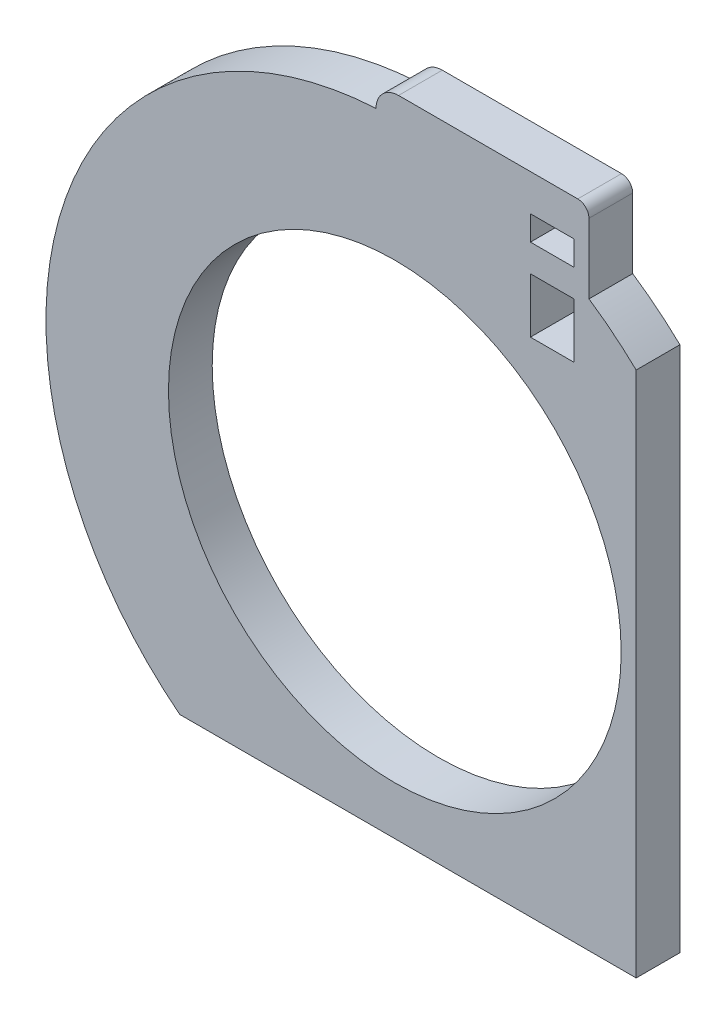
ISO-10303-21;
HEADER;
FILE_DESCRIPTION(('STEP AP214'),'2;1');
FILE_NAME('part.step','',(''),(''),'','','');
FILE_SCHEMA(('AUTOMOTIVE_DESIGN { 1 0 10303 214 1 1 1 1 }'));
ENDSEC;
DATA;
#1=APPLICATION_CONTEXT('core data for automotive mechanical design processes');
#2=APPLICATION_PROTOCOL_DEFINITION('international standard','automotive_design',2000,#1);
#3=PRODUCT_CONTEXT('',#1,'mechanical');
#4=PRODUCT('Part','Part','',(#3));
#5=PRODUCT_RELATED_PRODUCT_CATEGORY('part','',(#4));
#6=PRODUCT_DEFINITION_FORMATION('','',#4);
#7=PRODUCT_DEFINITION_CONTEXT('part definition',#1,'design');
#8=PRODUCT_DEFINITION('design','',#6,#7);
#9=PRODUCT_DEFINITION_SHAPE('','',#8);
#10=(LENGTH_UNIT() NAMED_UNIT(*) SI_UNIT(.MILLI.,.METRE.));
#11=(NAMED_UNIT(*) PLANE_ANGLE_UNIT() SI_UNIT($,.RADIAN.));
#12=(NAMED_UNIT(*) SI_UNIT($,.STERADIAN.) SOLID_ANGLE_UNIT());
#13=UNCERTAINTY_MEASURE_WITH_UNIT(LENGTH_MEASURE(1.E-05),#10,'distance_accuracy_value','');
#14=(GEOMETRIC_REPRESENTATION_CONTEXT(3) GLOBAL_UNCERTAINTY_ASSIGNED_CONTEXT((#13)) GLOBAL_UNIT_ASSIGNED_CONTEXT((#10,
#11,#12)) REPRESENTATION_CONTEXT('',''));
#15=CARTESIAN_POINT('',(0.,0.,0.));
#16=DIRECTION('',(0.,0.,1.));
#17=DIRECTION('',(1.,0.,0.));
#18=AXIS2_PLACEMENT_3D('',#15,#16,#17);
#19=CARTESIAN_POINT('',(0.,0.,5.));
#20=DIRECTION('',(0.,0.,1.));
#21=DIRECTION('',(1.,0.,0.));
#22=AXIS2_PLACEMENT_3D('',#19,#20,#21);
#23=PLANE('',#22);
#24=DIRECTION('',(0.,1.,0.));
#25=VECTOR('',#24,1.);
#26=CARTESIAN_POINT('',(15.5,32.2687019691372,5.));
#27=LINE('',#26,#25);
#28=CARTESIAN_POINT('',(15.5,25.9957959776358,5.));
#29=VERTEX_POINT('',#28);
#30=CARTESIAN_POINT('',(15.5,32.2687019691372,5.));
#31=VERTEX_POINT('',#30);
#32=EDGE_CURVE('E158',#29,#31,#27,.T.);
#33=ORIENTED_EDGE('',*,*,#32,.T.);
#34=DIRECTION('',(1.,0.,0.));
#35=VECTOR('',#34,1.);
#36=CARTESIAN_POINT('',(20.5,32.2687019691372,5.));
#37=LINE('',#36,#35);
#38=CARTESIAN_POINT('',(20.5,32.2687019691372,5.));
#39=VERTEX_POINT('',#38);
#40=EDGE_CURVE('E147',#31,#39,#37,.T.);
#41=ORIENTED_EDGE('',*,*,#40,.T.);
#42=DIRECTION('',(0.,-1.,0.));
#43=VECTOR('',#42,1.);
#44=CARTESIAN_POINT('',(20.5,32.2687019691372,5.));
#45=LINE('',#44,#43);
#46=CARTESIAN_POINT('',(20.5,25.9957959776358,5.));
#47=VERTEX_POINT('',#46);
#48=EDGE_CURVE('E168',#39,#47,#45,.T.);
#49=ORIENTED_EDGE('',*,*,#48,.T.);
#50=DIRECTION('',(-1.,0.,0.));
#51=VECTOR('',#50,1.);
#52=CARTESIAN_POINT('',(20.5,25.9957959776358,5.));
#53=LINE('',#52,#51);
#54=EDGE_CURVE('E164',#47,#29,#53,.T.);
#55=ORIENTED_EDGE('',*,*,#54,.T.);
#56=EDGE_LOOP('',(#33,#41,#49,#55));
#57=FACE_BOUND('',#56,.T.);
#58=DIRECTION('',(0.,1.,0.));
#59=VECTOR('',#58,1.);
#60=CARTESIAN_POINT('',(15.5,38.2072364060484,5.));
#61=LINE('',#60,#59);
#62=CARTESIAN_POINT('',(15.5,35.4002041784689,5.));
#63=VERTEX_POINT('',#62);
#64=CARTESIAN_POINT('',(15.5,38.2072364060484,5.));
#65=VERTEX_POINT('',#64);
#66=EDGE_CURVE('E187',#63,#65,#61,.T.);
#67=ORIENTED_EDGE('',*,*,#66,.T.);
#68=DIRECTION('',(1.,0.,0.));
#69=VECTOR('',#68,1.);
#70=CARTESIAN_POINT('',(20.5,38.2072364060484,5.));
#71=LINE('',#70,#69);
#72=CARTESIAN_POINT('',(20.5,38.2072364060484,5.));
#73=VERTEX_POINT('',#72);
#74=EDGE_CURVE('E204',#65,#73,#71,.T.);
#75=ORIENTED_EDGE('',*,*,#74,.T.);
#76=DIRECTION('',(0.,-1.,0.));
#77=VECTOR('',#76,1.);
#78=CARTESIAN_POINT('',(20.5,38.2072364060484,5.));
#79=LINE('',#78,#77);
#80=CARTESIAN_POINT('',(20.5,35.4002041784689,5.));
#81=VERTEX_POINT('',#80);
#82=EDGE_CURVE('E154',#73,#81,#79,.T.);
#83=ORIENTED_EDGE('',*,*,#82,.T.);
#84=DIRECTION('',(-1.,0.,0.));
#85=VECTOR('',#84,1.);
#86=CARTESIAN_POINT('',(20.5,35.4002041784689,5.));
#87=LINE('',#86,#85);
#88=EDGE_CURVE('E184',#81,#63,#87,.T.);
#89=ORIENTED_EDGE('',*,*,#88,.T.);
#90=EDGE_LOOP('',(#67,#75,#83,#89));
#91=FACE_BOUND('',#90,.T.);
#92=CARTESIAN_POINT('',(0.,0.,5.));
#93=DIRECTION('',(0.,0.,1.));
#94=DIRECTION('',(1.,0.,0.));
#95=AXIS2_PLACEMENT_3D('',#92,#93,#94);
#96=CIRCLE('',#95,39.8690409108862);
#97=CARTESIAN_POINT('',(-2.14506824428968,39.811293691379,5.));
#98=VERTEX_POINT('',#97);
#99=CARTESIAN_POINT('',(-24.576892052644,-31.3929418848668,5.));
#100=VERTEX_POINT('',#99);
#101=EDGE_CURVE('E220',#98,#100,#96,.T.);
#102=ORIENTED_EDGE('',*,*,#101,.T.);
#103=DIRECTION('',(1.,0.,0.));
#104=VECTOR('',#103,1.);
#105=CARTESIAN_POINT('',(27.5855038769169,-31.3929418848668,5.));
#106=LINE('',#105,#104);
#107=CARTESIAN_POINT('',(27.5855038769169,-31.3929418848668,5.));
#108=VERTEX_POINT('',#107);
#109=EDGE_CURVE('E223',#100,#108,#106,.T.);
#110=ORIENTED_EDGE('',*,*,#109,.T.);
#111=DIRECTION('',(0.,1.,0.));
#112=VECTOR('',#111,1.);
#113=CARTESIAN_POINT('',(27.5855038769169,-31.3929418848668,5.));
#114=LINE('',#113,#112);
#115=CARTESIAN_POINT('',(27.5855038769169,28.7850725031308,5.));
#116=VERTEX_POINT('',#115);
#117=EDGE_CURVE('E226',#108,#116,#114,.T.);
#118=ORIENTED_EDGE('',*,*,#117,.T.);
#119=CARTESIAN_POINT('',(0.,0.,5.));
#120=DIRECTION('',(0.,0.,1.));
#121=DIRECTION('',(1.,0.,0.));
#122=AXIS2_PLACEMENT_3D('',#119,#120,#121);
#123=CIRCLE('',#122,39.8690409108859);
#124=CARTESIAN_POINT('',(22.1896090218943,33.1234309003364,5.));
#125=VERTEX_POINT('',#124);
#126=EDGE_CURVE('E228',#116,#125,#123,.T.);
#127=ORIENTED_EDGE('',*,*,#126,.T.);
#128=DIRECTION('',(0.,1.,0.));
#129=VECTOR('',#128,1.);
#130=CARTESIAN_POINT('',(22.1896090218943,41.1045457784081,5.));
#131=LINE('',#130,#129);
#132=CARTESIAN_POINT('',(22.1896090218943,41.1045457784081,5.));
#133=VERTEX_POINT('',#132);
#134=EDGE_CURVE('E230',#125,#133,#131,.T.);
#135=ORIENTED_EDGE('',*,*,#134,.T.);
#136=CARTESIAN_POINT('',(20.9106743505485,41.1045457784081,5.));
#137=DIRECTION('',(0.,0.,1.));
#138=DIRECTION('',(1.,0.,0.));
#139=AXIS2_PLACEMENT_3D('',#136,#137,#138);
#140=CIRCLE('',#139,1.27893467134576);
#141=CARTESIAN_POINT('',(20.9106743505485,42.3834804497538,5.));
#142=VERTEX_POINT('',#141);
#143=EDGE_CURVE('E232',#133,#142,#140,.T.);
#144=ORIENTED_EDGE('',*,*,#143,.T.);
#145=DIRECTION('',(-1.,0.,0.));
#146=VECTOR('',#145,1.);
#147=CARTESIAN_POINT('',(20.9106743505485,42.3834804497538,5.));
#148=LINE('',#147,#146);
#149=CARTESIAN_POINT('',(0.427118514085164,42.3834804497538,5.));
#150=VERTEX_POINT('',#149);
#151=EDGE_CURVE('E234',#142,#150,#148,.T.);
#152=ORIENTED_EDGE('',*,*,#151,.T.);
#153=CARTESIAN_POINT('',(0.427118514085164,39.811293691379,5.));
#154=DIRECTION('',(0.,0.,1.));
#155=DIRECTION('',(1.,0.,0.));
#156=AXIS2_PLACEMENT_3D('',#153,#154,#155);
#157=CIRCLE('',#156,2.57218675837485);
#158=EDGE_CURVE('E236',#150,#98,#157,.T.);
#159=ORIENTED_EDGE('',*,*,#158,.T.);
#160=EDGE_LOOP('',(#102,#110,#118,#127,#135,#144,#152,#159));
#161=FACE_BOUND('',#160,.T.);
#162=CARTESIAN_POINT('',(0.,0.,5.));
#163=DIRECTION('',(0.,0.,1.));
#164=DIRECTION('',(1.,0.,0.));
#165=AXIS2_PLACEMENT_3D('',#162,#163,#164);
#166=CIRCLE('',#165,25.8690409108859);
#167=CARTESIAN_POINT('',(25.8690409108859,0.,5.));
#168=VERTEX_POINT('',#167);
#169=EDGE_CURVE('E214',#168,#168,#166,.T.);
#170=ORIENTED_EDGE('',*,*,#169,.F.);
#171=EDGE_LOOP('',(#170));
#172=FACE_BOUND('',#171,.T.);
#173=ADVANCED_FACE('F35',(#57,#91,#161,#172),#23,.T.);
#174=CARTESIAN_POINT('',(0.,0.,0.));
#175=DIRECTION('',(0.,0.,1.));
#176=DIRECTION('',(1.,0.,0.));
#177=AXIS2_PLACEMENT_3D('',#174,#175,#176);
#178=PLANE('',#177);
#179=DIRECTION('',(1.,0.,0.));
#180=VECTOR('',#179,1.);
#181=CARTESIAN_POINT('',(20.5,32.2687019691372,0.));
#182=LINE('',#181,#180);
#183=CARTESIAN_POINT('',(15.5,32.2687019691372,0.));
#184=VERTEX_POINT('',#183);
#185=CARTESIAN_POINT('',(20.5,32.2687019691372,0.));
#186=VERTEX_POINT('',#185);
#187=EDGE_CURVE('E166',#184,#186,#182,.T.);
#188=ORIENTED_EDGE('',*,*,#187,.F.);
#189=DIRECTION('',(0.,1.,0.));
#190=VECTOR('',#189,1.);
#191=CARTESIAN_POINT('',(15.5,32.2687019691372,0.));
#192=LINE('',#191,#190);
#193=CARTESIAN_POINT('',(15.5,25.9957959776358,0.));
#194=VERTEX_POINT('',#193);
#195=EDGE_CURVE('E58',#194,#184,#192,.T.);
#196=ORIENTED_EDGE('',*,*,#195,.F.);
#197=DIRECTION('',(-1.,0.,0.));
#198=VECTOR('',#197,1.);
#199=CARTESIAN_POINT('',(20.5,25.9957959776358,0.));
#200=LINE('',#199,#198);
#201=CARTESIAN_POINT('',(20.5,25.9957959776358,0.));
#202=VERTEX_POINT('',#201);
#203=EDGE_CURVE('E160',#202,#194,#200,.T.);
#204=ORIENTED_EDGE('',*,*,#203,.F.);
#205=DIRECTION('',(0.,-1.,0.));
#206=VECTOR('',#205,1.);
#207=CARTESIAN_POINT('',(20.5,32.2687019691372,0.));
#208=LINE('',#207,#206);
#209=EDGE_CURVE('E173',#186,#202,#208,.T.);
#210=ORIENTED_EDGE('',*,*,#209,.F.);
#211=EDGE_LOOP('',(#188,#196,#204,#210));
#212=FACE_BOUND('',#211,.T.);
#213=DIRECTION('',(1.,0.,0.));
#214=VECTOR('',#213,1.);
#215=CARTESIAN_POINT('',(20.5,38.2072364060484,0.));
#216=LINE('',#215,#214);
#217=CARTESIAN_POINT('',(15.5,38.2072364060484,0.));
#218=VERTEX_POINT('',#217);
#219=CARTESIAN_POINT('',(20.5,38.2072364060484,0.));
#220=VERTEX_POINT('',#219);
#221=EDGE_CURVE('E192',#218,#220,#216,.T.);
#222=ORIENTED_EDGE('',*,*,#221,.F.);
#223=DIRECTION('',(0.,1.,0.));
#224=VECTOR('',#223,1.);
#225=CARTESIAN_POINT('',(15.5,38.2072364060484,0.));
#226=LINE('',#225,#224);
#227=CARTESIAN_POINT('',(15.5,35.4002041784689,0.));
#228=VERTEX_POINT('',#227);
#229=EDGE_CURVE('E190',#228,#218,#226,.T.);
#230=ORIENTED_EDGE('',*,*,#229,.F.);
#231=DIRECTION('',(-1.,0.,0.));
#232=VECTOR('',#231,1.);
#233=CARTESIAN_POINT('',(20.5,35.4002041784689,0.));
#234=LINE('',#233,#232);
#235=CARTESIAN_POINT('',(20.5,35.4002041784689,0.));
#236=VERTEX_POINT('',#235);
#237=EDGE_CURVE('E198',#236,#228,#234,.T.);
#238=ORIENTED_EDGE('',*,*,#237,.F.);
#239=DIRECTION('',(0.,-1.,0.));
#240=VECTOR('',#239,1.);
#241=CARTESIAN_POINT('',(20.5,38.2072364060484,0.));
#242=LINE('',#241,#240);
#243=EDGE_CURVE('E195',#220,#236,#242,.T.);
#244=ORIENTED_EDGE('',*,*,#243,.F.);
#245=EDGE_LOOP('',(#222,#230,#238,#244));
#246=FACE_BOUND('',#245,.T.);
#247=CARTESIAN_POINT('',(0.,0.,0.));
#248=DIRECTION('',(0.,0.,1.));
#249=DIRECTION('',(1.,0.,0.));
#250=AXIS2_PLACEMENT_3D('',#247,#248,#249);
#251=CIRCLE('',#250,39.8690409108862);
#252=CARTESIAN_POINT('',(-2.14506824428968,39.811293691379,0.));
#253=VERTEX_POINT('',#252);
#254=CARTESIAN_POINT('',(-24.576892052644,-31.3929418848668,0.));
#255=VERTEX_POINT('',#254);
#256=EDGE_CURVE('E217',#253,#255,#251,.T.);
#257=ORIENTED_EDGE('',*,*,#256,.F.);
#258=CARTESIAN_POINT('',(0.427118514085164,39.811293691379,0.));
#259=DIRECTION('',(0.,0.,1.));
#260=DIRECTION('',(1.,0.,0.));
#261=AXIS2_PLACEMENT_3D('',#258,#259,#260);
#262=CIRCLE('',#261,2.57218675837485);
#263=CARTESIAN_POINT('',(0.427118514085164,42.3834804497538,0.));
#264=VERTEX_POINT('',#263);
#265=EDGE_CURVE('E224',#264,#253,#262,.T.);
#266=ORIENTED_EDGE('',*,*,#265,.F.);
#267=DIRECTION('',(-1.,0.,0.));
#268=VECTOR('',#267,1.);
#269=CARTESIAN_POINT('',(20.9106743505485,42.3834804497538,0.));
#270=LINE('',#269,#268);
#271=CARTESIAN_POINT('',(20.9106743505485,42.3834804497538,0.));
#272=VERTEX_POINT('',#271);
#273=EDGE_CURVE('E251',#272,#264,#270,.T.);
#274=ORIENTED_EDGE('',*,*,#273,.F.);
#275=CARTESIAN_POINT('',(20.9106743505485,41.1045457784081,0.));
#276=DIRECTION('',(0.,0.,1.));
#277=DIRECTION('',(1.,0.,0.));
#278=AXIS2_PLACEMENT_3D('',#275,#276,#277);
#279=CIRCLE('',#278,1.27893467134576);
#280=CARTESIAN_POINT('',(22.1896090218943,41.1045457784081,0.));
#281=VERTEX_POINT('',#280);
#282=EDGE_CURVE('E249',#281,#272,#279,.T.);
#283=ORIENTED_EDGE('',*,*,#282,.F.);
#284=DIRECTION('',(0.,1.,0.));
#285=VECTOR('',#284,1.);
#286=CARTESIAN_POINT('',(22.1896090218943,41.1045457784081,0.));
#287=LINE('',#286,#285);
#288=CARTESIAN_POINT('',(22.1896090218943,33.1234309003364,0.));
#289=VERTEX_POINT('',#288);
#290=EDGE_CURVE('E247',#289,#281,#287,.T.);
#291=ORIENTED_EDGE('',*,*,#290,.F.);
#292=CARTESIAN_POINT('',(0.,0.,0.));
#293=DIRECTION('',(0.,0.,1.));
#294=DIRECTION('',(1.,0.,0.));
#295=AXIS2_PLACEMENT_3D('',#292,#293,#294);
#296=CIRCLE('',#295,39.8690409108859);
#297=CARTESIAN_POINT('',(27.5855038769169,28.7850725031308,0.));
#298=VERTEX_POINT('',#297);
#299=EDGE_CURVE('E245',#298,#289,#296,.T.);
#300=ORIENTED_EDGE('',*,*,#299,.F.);
#301=DIRECTION('',(0.,1.,0.));
#302=VECTOR('',#301,1.);
#303=CARTESIAN_POINT('',(27.5855038769169,-31.3929418848668,0.));
#304=LINE('',#303,#302);
#305=CARTESIAN_POINT('',(27.5855038769169,-31.3929418848668,0.));
#306=VERTEX_POINT('',#305);
#307=EDGE_CURVE('E243',#306,#298,#304,.T.);
#308=ORIENTED_EDGE('',*,*,#307,.F.);
#309=DIRECTION('',(1.,0.,0.));
#310=VECTOR('',#309,1.);
#311=CARTESIAN_POINT('',(27.5855038769169,-31.3929418848668,0.));
#312=LINE('',#311,#310);
#313=EDGE_CURVE('E241',#255,#306,#312,.T.);
#314=ORIENTED_EDGE('',*,*,#313,.F.);
#315=EDGE_LOOP('',(#257,#266,#274,#283,#291,#300,#308,#314));
#316=FACE_BOUND('',#315,.T.);
#317=CARTESIAN_POINT('',(0.,0.,0.));
#318=DIRECTION('',(0.,0.,1.));
#319=DIRECTION('',(1.,0.,0.));
#320=AXIS2_PLACEMENT_3D('',#317,#318,#319);
#321=CIRCLE('',#320,25.8690409108859);
#322=CARTESIAN_POINT('',(25.8690409108859,0.,0.));
#323=VERTEX_POINT('',#322);
#324=EDGE_CURVE('E213',#323,#323,#321,.T.);
#325=ORIENTED_EDGE('',*,*,#324,.T.);
#326=EDGE_LOOP('',(#325));
#327=FACE_BOUND('',#326,.T.);
#328=ADVANCED_FACE('F281',(#212,#246,#316,#327),#178,.F.);
#329=CARTESIAN_POINT('',(0.,0.,5.));
#330=DIRECTION('',(0.,0.,-1.));
#331=DIRECTION('',(-1.,0.,0.));
#332=AXIS2_PLACEMENT_3D('',#329,#330,#331);
#333=CYLINDRICAL_SURFACE('',#332,39.8690409108862);
#334=ORIENTED_EDGE('',*,*,#256,.T.);
#335=DIRECTION('',(0.,0.,-1.));
#336=VECTOR('',#335,1.);
#337=CARTESIAN_POINT('',(-24.576892052644,-31.3929418848668,5.));
#338=LINE('',#337,#336);
#339=EDGE_CURVE('E11',#100,#255,#338,.T.);
#340=ORIENTED_EDGE('',*,*,#339,.F.);
#341=ORIENTED_EDGE('',*,*,#101,.F.);
#342=DIRECTION('',(0.,0.,-1.));
#343=VECTOR('',#342,1.);
#344=CARTESIAN_POINT('',(-2.14506824428968,39.811293691379,5.));
#345=LINE('',#344,#343);
#346=EDGE_CURVE('E238',#98,#253,#345,.T.);
#347=ORIENTED_EDGE('',*,*,#346,.T.);
#348=EDGE_LOOP('',(#334,#340,#341,#347));
#349=FACE_BOUND('',#348,.T.);
#350=ADVANCED_FACE('F37',(#349),#333,.T.);
#351=CARTESIAN_POINT('',(27.5855038769169,-31.3929418848668,5.));
#352=DIRECTION('',(0.,1.,0.));
#353=DIRECTION('',(-1.,0.,0.));
#354=AXIS2_PLACEMENT_3D('',#351,#352,#353);
#355=PLANE('',#354);
#356=ORIENTED_EDGE('',*,*,#313,.T.);
#357=DIRECTION('',(0.,0.,-1.));
#358=VECTOR('',#357,1.);
#359=CARTESIAN_POINT('',(27.5855038769169,-31.3929418848668,5.));
#360=LINE('',#359,#358);
#361=EDGE_CURVE('E43',#108,#306,#360,.T.);
#362=ORIENTED_EDGE('',*,*,#361,.F.);
#363=ORIENTED_EDGE('',*,*,#109,.F.);
#364=ORIENTED_EDGE('',*,*,#339,.T.);
#365=EDGE_LOOP('',(#356,#362,#363,#364));
#366=FACE_BOUND('',#365,.T.);
#367=ADVANCED_FACE('F299',(#366),#355,.F.);
#368=CARTESIAN_POINT('',(27.5855038769169,-31.3929418848668,5.));
#369=DIRECTION('',(-1.,0.,0.));
#370=DIRECTION('',(0.,0.,1.));
#371=AXIS2_PLACEMENT_3D('',#368,#369,#370);
#372=PLANE('',#371);
#373=ORIENTED_EDGE('',*,*,#307,.T.);
#374=DIRECTION('',(0.,0.,-1.));
#375=VECTOR('',#374,1.);
#376=CARTESIAN_POINT('',(27.5855038769169,28.7850725031308,5.));
#377=LINE('',#376,#375);
#378=EDGE_CURVE('E268',#116,#298,#377,.T.);
#379=ORIENTED_EDGE('',*,*,#378,.F.);
#380=ORIENTED_EDGE('',*,*,#117,.F.);
#381=ORIENTED_EDGE('',*,*,#361,.T.);
#382=EDGE_LOOP('',(#373,#379,#380,#381));
#383=FACE_BOUND('',#382,.T.);
#384=ADVANCED_FACE('F275',(#383),#372,.F.);
#385=CARTESIAN_POINT('',(0.,0.,5.));
#386=DIRECTION('',(0.,0.,-1.));
#387=DIRECTION('',(-1.,0.,0.));
#388=AXIS2_PLACEMENT_3D('',#385,#386,#387);
#389=CYLINDRICAL_SURFACE('',#388,39.8690409108859);
#390=ORIENTED_EDGE('',*,*,#299,.T.);
#391=DIRECTION('',(0.,0.,-1.));
#392=VECTOR('',#391,1.);
#393=CARTESIAN_POINT('',(22.1896090218943,33.1234309003364,5.));
#394=LINE('',#393,#392);
#395=EDGE_CURVE('E265',#125,#289,#394,.T.);
#396=ORIENTED_EDGE('',*,*,#395,.F.);
#397=ORIENTED_EDGE('',*,*,#126,.F.);
#398=ORIENTED_EDGE('',*,*,#378,.T.);
#399=EDGE_LOOP('',(#390,#396,#397,#398));
#400=FACE_BOUND('',#399,.T.);
#401=ADVANCED_FACE('F287',(#400),#389,.T.);
#402=CARTESIAN_POINT('',(22.1896090218943,41.1045457784081,5.));
#403=DIRECTION('',(-1.,0.,0.));
#404=DIRECTION('',(0.,0.,1.));
#405=AXIS2_PLACEMENT_3D('',#402,#403,#404);
#406=PLANE('',#405);
#407=ORIENTED_EDGE('',*,*,#290,.T.);
#408=DIRECTION('',(0.,0.,-1.));
#409=VECTOR('',#408,1.);
#410=CARTESIAN_POINT('',(22.1896090218943,41.1045457784081,5.));
#411=LINE('',#410,#409);
#412=EDGE_CURVE('E262',#133,#281,#411,.T.);
#413=ORIENTED_EDGE('',*,*,#412,.F.);
#414=ORIENTED_EDGE('',*,*,#134,.F.);
#415=ORIENTED_EDGE('',*,*,#395,.T.);
#416=EDGE_LOOP('',(#407,#413,#414,#415));
#417=FACE_BOUND('',#416,.T.);
#418=ADVANCED_FACE('F291',(#417),#406,.F.);
#419=CARTESIAN_POINT('',(20.9106743505485,41.1045457784081,5.));
#420=DIRECTION('',(0.,0.,-1.));
#421=DIRECTION('',(-1.,0.,0.));
#422=AXIS2_PLACEMENT_3D('',#419,#420,#421);
#423=CYLINDRICAL_SURFACE('',#422,1.27893467134576);
#424=ORIENTED_EDGE('',*,*,#282,.T.);
#425=DIRECTION('',(0.,0.,-1.));
#426=VECTOR('',#425,1.);
#427=CARTESIAN_POINT('',(20.9106743505485,42.3834804497538,5.));
#428=LINE('',#427,#426);
#429=EDGE_CURVE('E259',#142,#272,#428,.T.);
#430=ORIENTED_EDGE('',*,*,#429,.F.);
#431=ORIENTED_EDGE('',*,*,#143,.F.);
#432=ORIENTED_EDGE('',*,*,#412,.T.);
#433=EDGE_LOOP('',(#424,#430,#431,#432));
#434=FACE_BOUND('',#433,.T.);
#435=ADVANCED_FACE('F312',(#434),#423,.T.);
#436=CARTESIAN_POINT('',(20.9106743505485,42.3834804497538,5.));
#437=DIRECTION('',(0.,-1.,0.));
#438=DIRECTION('',(0.,0.,-1.));
#439=AXIS2_PLACEMENT_3D('',#436,#437,#438);
#440=PLANE('',#439);
#441=ORIENTED_EDGE('',*,*,#273,.T.);
#442=DIRECTION('',(0.,0.,-1.));
#443=VECTOR('',#442,1.);
#444=CARTESIAN_POINT('',(0.427118514085164,42.3834804497538,5.));
#445=LINE('',#444,#443);
#446=EDGE_CURVE('E256',#150,#264,#445,.T.);
#447=ORIENTED_EDGE('',*,*,#446,.F.);
#448=ORIENTED_EDGE('',*,*,#151,.F.);
#449=ORIENTED_EDGE('',*,*,#429,.T.);
#450=EDGE_LOOP('',(#441,#447,#448,#449));
#451=FACE_BOUND('',#450,.T.);
#452=ADVANCED_FACE('F310',(#451),#440,.F.);
#453=CARTESIAN_POINT('',(0.427118514085164,39.811293691379,5.));
#454=DIRECTION('',(0.,0.,-1.));
#455=DIRECTION('',(-1.,0.,0.));
#456=AXIS2_PLACEMENT_3D('',#453,#454,#455);
#457=CYLINDRICAL_SURFACE('',#456,2.57218675837485);
#458=ORIENTED_EDGE('',*,*,#265,.T.);
#459=ORIENTED_EDGE('',*,*,#346,.F.);
#460=ORIENTED_EDGE('',*,*,#158,.F.);
#461=ORIENTED_EDGE('',*,*,#446,.T.);
#462=EDGE_LOOP('',(#458,#459,#460,#461));
#463=FACE_BOUND('',#462,.T.);
#464=ADVANCED_FACE('F305',(#463),#457,.T.);
#465=CARTESIAN_POINT('',(0.,0.,5.));
#466=DIRECTION('',(0.,0.,-1.));
#467=DIRECTION('',(-1.,0.,0.));
#468=AXIS2_PLACEMENT_3D('',#465,#466,#467);
#469=CYLINDRICAL_SURFACE('',#468,25.8690409108859);
#470=ORIENTED_EDGE('',*,*,#169,.T.);
#471=EDGE_LOOP('',(#470));
#472=FACE_BOUND('',#471,.T.);
#473=ORIENTED_EDGE('',*,*,#324,.F.);
#474=EDGE_LOOP('',(#473));
#475=FACE_BOUND('',#474,.T.);
#476=ADVANCED_FACE('F329',(#472,#475),#469,.F.);
#477=CARTESIAN_POINT('',(15.5,38.2072364060484,5.001));
#478=DIRECTION('',(-1.,0.,0.));
#479=DIRECTION('',(0.,-1.,0.));
#480=AXIS2_PLACEMENT_3D('',#477,#478,#479);
#481=PLANE('',#480);
#482=DIRECTION('',(0.,0.,-1.));
#483=VECTOR('',#482,1.);
#484=CARTESIAN_POINT('',(15.5,35.4002041784689,5.001));
#485=LINE('',#484,#483);
#486=EDGE_CURVE('E202',#63,#228,#485,.T.);
#487=ORIENTED_EDGE('',*,*,#486,.T.);
#488=ORIENTED_EDGE('',*,*,#229,.T.);
#489=DIRECTION('',(0.,0.,-1.));
#490=VECTOR('',#489,1.);
#491=CARTESIAN_POINT('',(15.5,38.2072364060484,5.001));
#492=LINE('',#491,#490);
#493=EDGE_CURVE('E201',#65,#218,#492,.T.);
#494=ORIENTED_EDGE('',*,*,#493,.F.);
#495=ORIENTED_EDGE('',*,*,#66,.F.);
#496=EDGE_LOOP('',(#487,#488,#494,#495));
#497=FACE_BOUND('',#496,.T.);
#498=ADVANCED_FACE('F336',(#497),#481,.F.);
#499=CARTESIAN_POINT('',(20.5,35.4002041784689,5.001));
#500=DIRECTION('',(0.,-1.,0.));
#501=DIRECTION('',(0.,0.,-1.));
#502=AXIS2_PLACEMENT_3D('',#499,#500,#501);
#503=PLANE('',#502);
#504=DIRECTION('',(0.,0.,-1.));
#505=VECTOR('',#504,1.);
#506=CARTESIAN_POINT('',(20.5,35.4002041784689,5.001));
#507=LINE('',#506,#505);
#508=EDGE_CURVE('E205',#81,#236,#507,.T.);
#509=ORIENTED_EDGE('',*,*,#508,.T.);
#510=ORIENTED_EDGE('',*,*,#237,.T.);
#511=ORIENTED_EDGE('',*,*,#486,.F.);
#512=ORIENTED_EDGE('',*,*,#88,.F.);
#513=EDGE_LOOP('',(#509,#510,#511,#512));
#514=FACE_BOUND('',#513,.T.);
#515=ADVANCED_FACE('F341',(#514),#503,.F.);
#516=CARTESIAN_POINT('',(20.5,38.2072364060484,5.001));
#517=DIRECTION('',(1.,0.,0.));
#518=DIRECTION('',(0.,1.,0.));
#519=AXIS2_PLACEMENT_3D('',#516,#517,#518);
#520=PLANE('',#519);
#521=DIRECTION('',(0.,0.,-1.));
#522=VECTOR('',#521,1.);
#523=CARTESIAN_POINT('',(20.5,38.2072364060484,5.001));
#524=LINE('',#523,#522);
#525=EDGE_CURVE('E207',#73,#220,#524,.T.);
#526=ORIENTED_EDGE('',*,*,#525,.T.);
#527=ORIENTED_EDGE('',*,*,#243,.T.);
#528=ORIENTED_EDGE('',*,*,#508,.F.);
#529=ORIENTED_EDGE('',*,*,#82,.F.);
#530=EDGE_LOOP('',(#526,#527,#528,#529));
#531=FACE_BOUND('',#530,.T.);
#532=ADVANCED_FACE('F349',(#531),#520,.F.);
#533=CARTESIAN_POINT('',(20.5,38.2072364060484,5.001));
#534=DIRECTION('',(0.,1.,0.));
#535=DIRECTION('',(0.,0.,1.));
#536=AXIS2_PLACEMENT_3D('',#533,#534,#535);
#537=PLANE('',#536);
#538=ORIENTED_EDGE('',*,*,#493,.T.);
#539=ORIENTED_EDGE('',*,*,#221,.T.);
#540=ORIENTED_EDGE('',*,*,#525,.F.);
#541=ORIENTED_EDGE('',*,*,#74,.F.);
#542=EDGE_LOOP('',(#538,#539,#540,#541));
#543=FACE_BOUND('',#542,.T.);
#544=ADVANCED_FACE('F353',(#543),#537,.F.);
#545=CARTESIAN_POINT('',(15.5,32.2687019691372,5.001));
#546=DIRECTION('',(-1.,0.,0.));
#547=DIRECTION('',(0.,0.,1.));
#548=AXIS2_PLACEMENT_3D('',#545,#546,#547);
#549=PLANE('',#548);
#550=DIRECTION('',(0.,0.,-1.));
#551=VECTOR('',#550,1.);
#552=CARTESIAN_POINT('',(15.5,25.9957959776358,5.001));
#553=LINE('',#552,#551);
#554=EDGE_CURVE('E155',#29,#194,#553,.T.);
#555=ORIENTED_EDGE('',*,*,#554,.T.);
#556=ORIENTED_EDGE('',*,*,#195,.T.);
#557=DIRECTION('',(0.,0.,-1.));
#558=VECTOR('',#557,1.);
#559=CARTESIAN_POINT('',(15.5,32.2687019691372,5.001));
#560=LINE('',#559,#558);
#561=EDGE_CURVE('E149',#31,#184,#560,.T.);
#562=ORIENTED_EDGE('',*,*,#561,.F.);
#563=ORIENTED_EDGE('',*,*,#32,.F.);
#564=EDGE_LOOP('',(#555,#556,#562,#563));
#565=FACE_BOUND('',#564,.T.);
#566=ADVANCED_FACE('F157',(#565),#549,.F.);
#567=CARTESIAN_POINT('',(20.5,25.9957959776358,5.001));
#568=DIRECTION('',(0.,-1.,0.));
#569=DIRECTION('',(0.,0.,-1.));
#570=AXIS2_PLACEMENT_3D('',#567,#568,#569);
#571=PLANE('',#570);
#572=DIRECTION('',(0.,0.,-1.));
#573=VECTOR('',#572,1.);
#574=CARTESIAN_POINT('',(20.5,25.9957959776358,5.001));
#575=LINE('',#574,#573);
#576=EDGE_CURVE('E179',#47,#202,#575,.T.);
#577=ORIENTED_EDGE('',*,*,#576,.T.);
#578=ORIENTED_EDGE('',*,*,#203,.T.);
#579=ORIENTED_EDGE('',*,*,#554,.F.);
#580=ORIENTED_EDGE('',*,*,#54,.F.);
#581=EDGE_LOOP('',(#577,#578,#579,#580));
#582=FACE_BOUND('',#581,.T.);
#583=ADVANCED_FACE('F362',(#582),#571,.F.);
#584=CARTESIAN_POINT('',(20.5,32.2687019691372,5.001));
#585=DIRECTION('',(1.,0.,0.));
#586=DIRECTION('',(0.,0.,-1.));
#587=AXIS2_PLACEMENT_3D('',#584,#585,#586);
#588=PLANE('',#587);
#589=DIRECTION('',(0.,0.,-1.));
#590=VECTOR('',#589,1.);
#591=CARTESIAN_POINT('',(20.5,32.2687019691372,5.001));
#592=LINE('',#591,#590);
#593=EDGE_CURVE('E50',#39,#186,#592,.T.);
#594=ORIENTED_EDGE('',*,*,#593,.T.);
#595=ORIENTED_EDGE('',*,*,#209,.T.);
#596=ORIENTED_EDGE('',*,*,#576,.F.);
#597=ORIENTED_EDGE('',*,*,#48,.F.);
#598=EDGE_LOOP('',(#594,#595,#596,#597));
#599=FACE_BOUND('',#598,.T.);
#600=ADVANCED_FACE('F365',(#599),#588,.F.);
#601=CARTESIAN_POINT('',(20.5,32.2687019691372,5.001));
#602=DIRECTION('',(0.,1.,0.));
#603=DIRECTION('',(0.,0.,1.));
#604=AXIS2_PLACEMENT_3D('',#601,#602,#603);
#605=PLANE('',#604);
#606=ORIENTED_EDGE('',*,*,#561,.T.);
#607=ORIENTED_EDGE('',*,*,#187,.T.);
#608=ORIENTED_EDGE('',*,*,#593,.F.);
#609=ORIENTED_EDGE('',*,*,#40,.F.);
#610=EDGE_LOOP('',(#606,#607,#608,#609));
#611=FACE_BOUND('',#610,.T.);
#612=ADVANCED_FACE('F148',(#611),#605,.F.);
#613=CLOSED_SHELL('',(#173,#328,#350,#367,#384,#401,#418,#435,#452,#464,#476,#498,#515,#532,
#544,#566,#583,#600,#612));
#614=MANIFOLD_SOLID_BREP('B2',#613);
#615=ADVANCED_BREP_SHAPE_REPRESENTATION('',(#18,#614),#14);
#616=SHAPE_DEFINITION_REPRESENTATION(#9,#615);
ENDSEC;
END-ISO-10303-21;
